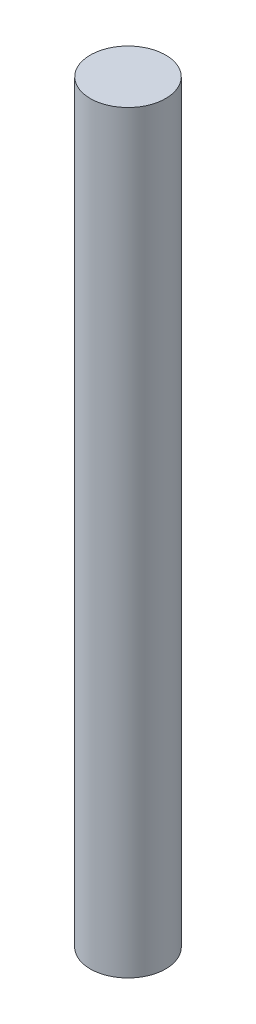
ISO-10303-21;
HEADER;
FILE_DESCRIPTION(('STEP AP214'),'2;1');
FILE_NAME('part.step','',(''),(''),'','','');
FILE_SCHEMA(('AUTOMOTIVE_DESIGN { 1 0 10303 214 1 1 1 1 }'));
ENDSEC;
DATA;
#1=APPLICATION_CONTEXT('core data for automotive mechanical design processes');
#2=APPLICATION_PROTOCOL_DEFINITION('international standard','automotive_design',2000,#1);
#3=PRODUCT_CONTEXT('',#1,'mechanical');
#4=PRODUCT('Part','Part','',(#3));
#5=PRODUCT_RELATED_PRODUCT_CATEGORY('part','',(#4));
#6=PRODUCT_DEFINITION_FORMATION('','',#4);
#7=PRODUCT_DEFINITION_CONTEXT('part definition',#1,'design');
#8=PRODUCT_DEFINITION('design','',#6,#7);
#9=PRODUCT_DEFINITION_SHAPE('','',#8);
#10=(LENGTH_UNIT() NAMED_UNIT(*) SI_UNIT(.MILLI.,.METRE.));
#11=(NAMED_UNIT(*) PLANE_ANGLE_UNIT() SI_UNIT($,.RADIAN.));
#12=(NAMED_UNIT(*) SI_UNIT($,.STERADIAN.) SOLID_ANGLE_UNIT());
#13=UNCERTAINTY_MEASURE_WITH_UNIT(LENGTH_MEASURE(1.E-05),#10,'distance_accuracy_value','');
#14=(GEOMETRIC_REPRESENTATION_CONTEXT(3) GLOBAL_UNCERTAINTY_ASSIGNED_CONTEXT((#13)) GLOBAL_UNIT_ASSIGNED_CONTEXT((#10,
#11,#12)) REPRESENTATION_CONTEXT('',''));
#15=CARTESIAN_POINT('',(0.,0.,0.));
#16=DIRECTION('',(0.,0.,1.));
#17=DIRECTION('',(1.,0.,0.));
#18=AXIS2_PLACEMENT_3D('',#15,#16,#17);
#19=CARTESIAN_POINT('',(0.,100.,0.));
#20=DIRECTION('',(0.,-1.,0.));
#21=DIRECTION('',(0.,0.,-1.));
#22=AXIS2_PLACEMENT_3D('',#19,#20,#21);
#23=CYLINDRICAL_SURFACE('',#22,10.);
#24=CARTESIAN_POINT('',(0.,100.,0.));
#25=DIRECTION('',(0.,1.,0.));
#26=DIRECTION('',(0.,0.,1.));
#27=AXIS2_PLACEMENT_3D('',#24,#25,#26);
#28=CIRCLE('',#27,10.);
#29=CARTESIAN_POINT('',(0.,100.,10.));
#30=VERTEX_POINT('',#29);
#31=EDGE_CURVE('E10',#30,#30,#28,.T.);
#32=ORIENTED_EDGE('',*,*,#31,.F.);
#33=EDGE_LOOP('',(#32));
#34=FACE_BOUND('',#33,.T.);
#35=CARTESIAN_POINT('',(0.,-100.,0.));
#36=DIRECTION('',(0.,1.,0.));
#37=DIRECTION('',(0.,0.,1.));
#38=AXIS2_PLACEMENT_3D('',#35,#36,#37);
#39=CIRCLE('',#38,10.);
#40=CARTESIAN_POINT('',(0.,-100.,10.));
#41=VERTEX_POINT('',#40);
#42=EDGE_CURVE('E34',#41,#41,#39,.T.);
#43=ORIENTED_EDGE('',*,*,#42,.T.);
#44=EDGE_LOOP('',(#43));
#45=FACE_BOUND('',#44,.T.);
#46=ADVANCED_FACE('F31',(#34,#45),#23,.T.);
#47=CARTESIAN_POINT('',(0.,100.,0.));
#48=DIRECTION('',(0.,1.,0.));
#49=DIRECTION('',(0.,0.,1.));
#50=AXIS2_PLACEMENT_3D('',#47,#48,#49);
#51=PLANE('',#50);
#52=ORIENTED_EDGE('',*,*,#31,.T.);
#53=EDGE_LOOP('',(#52));
#54=FACE_BOUND('',#53,.T.);
#55=ADVANCED_FACE('F46',(#54),#51,.T.);
#56=CARTESIAN_POINT('',(0.,-100.,0.));
#57=DIRECTION('',(0.,1.,0.));
#58=DIRECTION('',(0.,0.,1.));
#59=AXIS2_PLACEMENT_3D('',#56,#57,#58);
#60=PLANE('',#59);
#61=ORIENTED_EDGE('',*,*,#42,.F.);
#62=EDGE_LOOP('',(#61));
#63=FACE_BOUND('',#62,.T.);
#64=ADVANCED_FACE('F44',(#63),#60,.F.);
#65=CLOSED_SHELL('',(#46,#55,#64));
#66=MANIFOLD_SOLID_BREP('B2',#65);
#67=ADVANCED_BREP_SHAPE_REPRESENTATION('',(#18,#66),#14);
#68=SHAPE_DEFINITION_REPRESENTATION(#9,#67);
ENDSEC;
END-ISO-10303-21;
